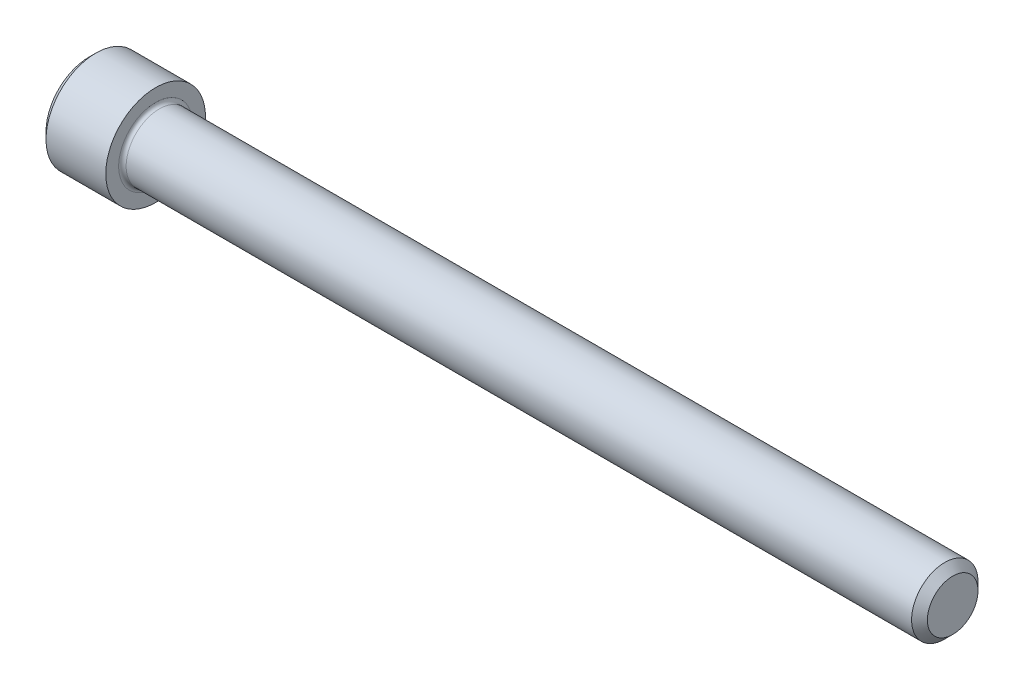
ISO-10303-21;
HEADER;
FILE_DESCRIPTION(('STEP AP214'),'2;1');
FILE_NAME('part.step','',(''),(''),'','','');
FILE_SCHEMA(('AUTOMOTIVE_DESIGN { 1 0 10303 214 1 1 1 1 }'));
ENDSEC;
DATA;
#1=APPLICATION_CONTEXT('core data for automotive mechanical design processes');
#2=APPLICATION_PROTOCOL_DEFINITION('international standard','automotive_design',2000,#1);
#3=PRODUCT_CONTEXT('',#1,'mechanical');
#4=PRODUCT('Part','Part','',(#3));
#5=PRODUCT_RELATED_PRODUCT_CATEGORY('part','',(#4));
#6=PRODUCT_DEFINITION_FORMATION('','',#4);
#7=PRODUCT_DEFINITION_CONTEXT('part definition',#1,'design');
#8=PRODUCT_DEFINITION('design','',#6,#7);
#9=PRODUCT_DEFINITION_SHAPE('','',#8);
#10=(LENGTH_UNIT() NAMED_UNIT(*) SI_UNIT(.MILLI.,.METRE.));
#11=(NAMED_UNIT(*) PLANE_ANGLE_UNIT() SI_UNIT($,.RADIAN.));
#12=(NAMED_UNIT(*) SI_UNIT($,.STERADIAN.) SOLID_ANGLE_UNIT());
#13=UNCERTAINTY_MEASURE_WITH_UNIT(LENGTH_MEASURE(1.E-05),#10,'distance_accuracy_value','');
#14=(GEOMETRIC_REPRESENTATION_CONTEXT(3) GLOBAL_UNCERTAINTY_ASSIGNED_CONTEXT((#13)) GLOBAL_UNIT_ASSIGNED_CONTEXT((#10,
#11,#12)) REPRESENTATION_CONTEXT('',''));
#15=CARTESIAN_POINT('',(0.,0.,0.));
#16=DIRECTION('',(0.,0.,1.));
#17=DIRECTION('',(1.,0.,0.));
#18=AXIS2_PLACEMENT_3D('',#15,#16,#17);
#19=CARTESIAN_POINT('',(0.,0.,0.));
#20=DIRECTION('',(-1.,0.,0.));
#21=DIRECTION('',(0.,0.,1.));
#22=AXIS2_PLACEMENT_3D('',#19,#20,#21);
#23=PLANE('',#22);
#24=DIRECTION('',(0.,-0.499999999999998,0.86602540378444));
#25=VECTOR('',#24,1.);
#26=CARTESIAN_POINT('',(0.,2.7496306570156,0.));
#27=LINE('',#26,#25);
#28=CARTESIAN_POINT('',(0.,2.7496306570156,0.));
#29=VERTEX_POINT('',#28);
#30=CARTESIAN_POINT('',(0.,1.37481532850781,2.38125));
#31=VERTEX_POINT('',#30);
#32=EDGE_CURVE('E387',#29,#31,#27,.T.);
#33=ORIENTED_EDGE('',*,*,#32,.T.);
#34=DIRECTION('',(0.,1.,0.));
#35=VECTOR('',#34,1.);
#36=CARTESIAN_POINT('',(0.,-1.37481532850779,2.38125));
#37=LINE('',#36,#35);
#38=CARTESIAN_POINT('',(0.,-1.37481532850779,2.38125));
#39=VERTEX_POINT('',#38);
#40=EDGE_CURVE('E131',#39,#31,#37,.T.);
#41=ORIENTED_EDGE('',*,*,#40,.F.);
#42=DIRECTION('',(0.,-0.500000000000001,-0.866025403784438));
#43=VECTOR('',#42,1.);
#44=CARTESIAN_POINT('',(0.,-1.37481532850779,2.38125));
#45=LINE('',#44,#43);
#46=CARTESIAN_POINT('',(0.,-2.74963065701559,0.));
#47=VERTEX_POINT('',#46);
#48=EDGE_CURVE('E390',#39,#47,#45,.T.);
#49=ORIENTED_EDGE('',*,*,#48,.T.);
#50=DIRECTION('',(0.,0.499999999999998,-0.86602540378444));
#51=VECTOR('',#50,1.);
#52=CARTESIAN_POINT('',(0.,-2.74963065701559,0.));
#53=LINE('',#52,#51);
#54=CARTESIAN_POINT('',(0.,-1.37481532850779,-2.38125));
#55=VERTEX_POINT('',#54);
#56=EDGE_CURVE('E393',#47,#55,#53,.T.);
#57=ORIENTED_EDGE('',*,*,#56,.T.);
#58=DIRECTION('',(0.,-1.,0.));
#59=VECTOR('',#58,1.);
#60=CARTESIAN_POINT('',(0.,1.3748153285078,-2.38125));
#61=LINE('',#60,#59);
#62=CARTESIAN_POINT('',(0.,1.3748153285078,-2.38125));
#63=VERTEX_POINT('',#62);
#64=EDGE_CURVE('E396',#63,#55,#61,.T.);
#65=ORIENTED_EDGE('',*,*,#64,.F.);
#66=DIRECTION('',(0.,-0.500000000000001,-0.866025403784438));
#67=VECTOR('',#66,1.);
#68=CARTESIAN_POINT('',(0.,2.7496306570156,0.));
#69=LINE('',#68,#67);
#70=EDGE_CURVE('E126',#29,#63,#69,.T.);
#71=ORIENTED_EDGE('',*,*,#70,.F.);
#72=EDGE_LOOP('',(#33,#41,#49,#57,#65,#71));
#73=FACE_BOUND('',#72,.T.);
#74=CARTESIAN_POINT('',(0.,0.,0.));
#75=DIRECTION('',(-1.,0.,0.));
#76=DIRECTION('',(0.,0.,1.));
#77=AXIS2_PLACEMENT_3D('',#74,#75,#76);
#78=CIRCLE('',#77,4.1275);
#79=CARTESIAN_POINT('',(0.,0.,4.1275));
#80=VERTEX_POINT('',#79);
#81=EDGE_CURVE('E142',#80,#80,#78,.T.);
#82=ORIENTED_EDGE('',*,*,#81,.T.);
#83=EDGE_LOOP('',(#82));
#84=FACE_BOUND('',#83,.T.);
#85=ADVANCED_FACE('F35',(#73,#84),#23,.T.);
#86=CARTESIAN_POINT('',(82.55,2.41935,0.));
#87=DIRECTION('',(1.,0.,0.));
#88=DIRECTION('',(0.,0.,-1.));
#89=AXIS2_PLACEMENT_3D('',#86,#87,#88);
#90=PLANE('',#89);
#91=CARTESIAN_POINT('',(82.55,0.,0.));
#92=DIRECTION('',(-1.,0.,0.));
#93=DIRECTION('',(0.,0.,1.));
#94=AXIS2_PLACEMENT_3D('',#91,#92,#93);
#95=CIRCLE('',#94,2.41935);
#96=CARTESIAN_POINT('',(82.55,0.,2.41935));
#97=VERTEX_POINT('',#96);
#98=EDGE_CURVE('E155',#97,#97,#95,.T.);
#99=ORIENTED_EDGE('',*,*,#98,.F.);
#100=EDGE_LOOP('',(#99));
#101=FACE_BOUND('',#100,.T.);
#102=ADVANCED_FACE('F176',(#101),#90,.T.);
#103=CARTESIAN_POINT('',(82.55,0.,0.));
#104=DIRECTION('',(-1.,0.,0.));
#105=DIRECTION('',(0.,0.,1.));
#106=AXIS2_PLACEMENT_3D('',#103,#104,#105);
#107=CONICAL_SURFACE('',#106,2.41935,0.785398163397347);
#108=CARTESIAN_POINT('',(81.7943499999999,0.,0.));
#109=DIRECTION('',(-1.,0.,0.));
#110=DIRECTION('',(0.,0.,1.));
#111=AXIS2_PLACEMENT_3D('',#108,#109,#110);
#112=CIRCLE('',#111,3.17499999999991);
#113=CARTESIAN_POINT('',(81.7943499999999,0.,3.17499999999991));
#114=VERTEX_POINT('',#113);
#115=EDGE_CURVE('E152',#114,#114,#112,.T.);
#116=ORIENTED_EDGE('',*,*,#115,.F.);
#117=EDGE_LOOP('',(#116));
#118=FACE_BOUND('',#117,.T.);
#119=ORIENTED_EDGE('',*,*,#98,.T.);
#120=EDGE_LOOP('',(#119));
#121=FACE_BOUND('',#120,.T.);
#122=ADVANCED_FACE('F182',(#118,#121),#107,.T.);
#123=CARTESIAN_POINT('',(-31.75,0.,0.));
#124=DIRECTION('',(-1.,0.,0.));
#125=DIRECTION('',(0.,0.,1.));
#126=AXIS2_PLACEMENT_3D('',#123,#124,#125);
#127=CYLINDRICAL_SURFACE('',#126,3.17499999999996);
#128=CARTESIAN_POINT('',(6.7056,0.,0.));
#129=DIRECTION('',(1.,0.,0.));
#130=DIRECTION('',(0.,0.,-1.));
#131=AXIS2_PLACEMENT_3D('',#128,#129,#130);
#132=CIRCLE('',#131,3.17499999999996);
#133=CARTESIAN_POINT('',(6.7056,0.,-3.17499999999996));
#134=VERTEX_POINT('',#133);
#135=EDGE_CURVE('E11',#134,#134,#132,.T.);
#136=ORIENTED_EDGE('',*,*,#135,.T.);
#137=EDGE_LOOP('',(#136));
#138=FACE_BOUND('',#137,.T.);
#139=ORIENTED_EDGE('',*,*,#115,.T.);
#140=EDGE_LOOP('',(#139));
#141=FACE_BOUND('',#140,.T.);
#142=ADVANCED_FACE('F193',(#138,#141),#127,.T.);
#143=CARTESIAN_POINT('',(6.35,4.7625,0.));
#144=DIRECTION('',(1.,0.,0.));
#145=DIRECTION('',(0.,0.,-1.));
#146=AXIS2_PLACEMENT_3D('',#143,#144,#145);
#147=PLANE('',#146);
#148=CARTESIAN_POINT('',(6.35,0.,0.));
#149=DIRECTION('',(1.,0.,0.));
#150=DIRECTION('',(0.,0.,-1.));
#151=AXIS2_PLACEMENT_3D('',#148,#149,#150);
#152=CIRCLE('',#151,3.53059999999996);
#153=CARTESIAN_POINT('',(6.35,0.,-3.53059999999996));
#154=VERTEX_POINT('',#153);
#155=EDGE_CURVE('E43',#154,#154,#152,.F.);
#156=ORIENTED_EDGE('',*,*,#155,.T.);
#157=EDGE_LOOP('',(#156));
#158=FACE_BOUND('',#157,.T.);
#159=CARTESIAN_POINT('',(6.35,0.,0.));
#160=DIRECTION('',(-1.,0.,0.));
#161=DIRECTION('',(0.,0.,1.));
#162=AXIS2_PLACEMENT_3D('',#159,#160,#161);
#163=CIRCLE('',#162,4.7625);
#164=CARTESIAN_POINT('',(6.35,0.,4.7625));
#165=VERTEX_POINT('',#164);
#166=EDGE_CURVE('E149',#165,#165,#163,.T.);
#167=ORIENTED_EDGE('',*,*,#166,.F.);
#168=EDGE_LOOP('',(#167));
#169=FACE_BOUND('',#168,.T.);
#170=ADVANCED_FACE('F160',(#158,#169),#147,.T.);
#171=CARTESIAN_POINT('',(-31.75,0.,0.));
#172=DIRECTION('',(-1.,0.,0.));
#173=DIRECTION('',(0.,0.,1.));
#174=AXIS2_PLACEMENT_3D('',#171,#172,#173);
#175=CYLINDRICAL_SURFACE('',#174,4.7625);
#176=ORIENTED_EDGE('',*,*,#166,.T.);
#177=EDGE_LOOP('',(#176));
#178=FACE_BOUND('',#177,.T.);
#179=CARTESIAN_POINT('',(0.634999999999997,0.,0.));
#180=DIRECTION('',(-1.,0.,0.));
#181=DIRECTION('',(0.,0.,1.));
#182=AXIS2_PLACEMENT_3D('',#179,#180,#181);
#183=CIRCLE('',#182,4.7625);
#184=CARTESIAN_POINT('',(0.634999999999997,0.,4.7625));
#185=VERTEX_POINT('',#184);
#186=EDGE_CURVE('E146',#185,#185,#183,.T.);
#187=ORIENTED_EDGE('',*,*,#186,.F.);
#188=EDGE_LOOP('',(#187));
#189=FACE_BOUND('',#188,.T.);
#190=ADVANCED_FACE('F171',(#178,#189),#175,.T.);
#191=CARTESIAN_POINT('',(0.,0.,0.));
#192=DIRECTION('',(1.,0.,0.));
#193=DIRECTION('',(0.,0.,-1.));
#194=AXIS2_PLACEMENT_3D('',#191,#192,#193);
#195=CONICAL_SURFACE('',#194,4.1275,0.785398163397449);
#196=ORIENTED_EDGE('',*,*,#186,.T.);
#197=EDGE_LOOP('',(#196));
#198=FACE_BOUND('',#197,.T.);
#199=ORIENTED_EDGE('',*,*,#81,.F.);
#200=EDGE_LOOP('',(#199));
#201=FACE_BOUND('',#200,.T.);
#202=ADVANCED_FACE('F164',(#198,#201),#195,.T.);
#203=CARTESIAN_POINT('',(6.7056,0.,0.));
#204=DIRECTION('',(1.,0.,0.));
#205=DIRECTION('',(0.,0.,-1.));
#206=AXIS2_PLACEMENT_3D('',#203,#204,#205);
#207=TOROIDAL_SURFACE('',#206,3.53059999999996,0.3556);
#208=ORIENTED_EDGE('',*,*,#135,.F.);
#209=EDGE_LOOP('',(#208));
#210=FACE_BOUND('',#209,.T.);
#211=ORIENTED_EDGE('',*,*,#155,.F.);
#212=EDGE_LOOP('',(#211));
#213=FACE_BOUND('',#212,.T.);
#214=ADVANCED_FACE('F37',(#210,#213),#207,.F.);
#215=CARTESIAN_POINT('',(3.048,2.7496306570156,0.));
#216=DIRECTION('',(0.,-0.86602540378444,-0.499999999999998));
#217=DIRECTION('',(0.,0.499999999999998,-0.86602540378444));
#218=AXIS2_PLACEMENT_3D('',#215,#216,#217);
#219=PLANE('',#218);
#220=ORIENTED_EDGE('',*,*,#32,.F.);
#221=DIRECTION('',(-1.,0.,0.));
#222=VECTOR('',#221,1.);
#223=CARTESIAN_POINT('',(3.048,2.7496306570156,0.));
#224=LINE('',#223,#222);
#225=CARTESIAN_POINT('',(3.048,2.7496306570156,0.));
#226=VERTEX_POINT('',#225);
#227=EDGE_CURVE('E377',#226,#29,#224,.T.);
#228=ORIENTED_EDGE('',*,*,#227,.F.);
#229=DIRECTION('',(0.,-0.499999999999998,0.86602540378444));
#230=VECTOR('',#229,1.);
#231=CARTESIAN_POINT('',(3.048,2.7496306570156,0.));
#232=LINE('',#231,#230);
#233=CARTESIAN_POINT('',(3.048,2.0622229927617,1.190625));
#234=VERTEX_POINT('',#233);
#235=EDGE_CURVE('E118',#226,#234,#232,.T.);
#236=ORIENTED_EDGE('',*,*,#235,.T.);
#237=CARTESIAN_POINT('',(3.048,1.37481532850781,2.38125));
#238=VERTEX_POINT('',#237);
#239=EDGE_CURVE('E109',#234,#238,#232,.T.);
#240=ORIENTED_EDGE('',*,*,#239,.T.);
#241=DIRECTION('',(-1.,0.,0.));
#242=VECTOR('',#241,1.);
#243=CARTESIAN_POINT('',(3.048,1.37481532850781,2.38125));
#244=LINE('',#243,#242);
#245=EDGE_CURVE('E123',#238,#31,#244,.T.);
#246=ORIENTED_EDGE('',*,*,#245,.T.);
#247=EDGE_LOOP('',(#220,#228,#236,#240,#246));
#248=FACE_BOUND('',#247,.T.);
#249=ADVANCED_FACE('F122',(#248),#219,.T.);
#250=CARTESIAN_POINT('',(3.048,-1.37481532850779,2.38125));
#251=DIRECTION('',(0.,0.,1.));
#252=DIRECTION('',(0.,-1.,0.));
#253=AXIS2_PLACEMENT_3D('',#250,#251,#252);
#254=PLANE('',#253);
#255=ORIENTED_EDGE('',*,*,#40,.T.);
#256=ORIENTED_EDGE('',*,*,#245,.F.);
#257=DIRECTION('',(0.,1.,0.));
#258=VECTOR('',#257,1.);
#259=CARTESIAN_POINT('',(3.048,-1.37481532850779,2.38125));
#260=LINE('',#259,#258);
#261=CARTESIAN_POINT('',(3.048,0.,2.38125));
#262=VERTEX_POINT('',#261);
#263=EDGE_CURVE('E106',#262,#238,#260,.T.);
#264=ORIENTED_EDGE('',*,*,#263,.F.);
#265=CARTESIAN_POINT('',(3.048,-1.37481532850779,2.38125));
#266=VERTEX_POINT('',#265);
#267=EDGE_CURVE('E117',#266,#262,#260,.T.);
#268=ORIENTED_EDGE('',*,*,#267,.F.);
#269=DIRECTION('',(-1.,0.,0.));
#270=VECTOR('',#269,1.);
#271=CARTESIAN_POINT('',(3.048,-1.37481532850779,2.38125));
#272=LINE('',#271,#270);
#273=EDGE_CURVE('E133',#266,#39,#272,.T.);
#274=ORIENTED_EDGE('',*,*,#273,.T.);
#275=EDGE_LOOP('',(#255,#256,#264,#268,#274));
#276=FACE_BOUND('',#275,.T.);
#277=ADVANCED_FACE('F128',(#276),#254,.F.);
#278=CARTESIAN_POINT('',(3.048,-1.37481532850779,2.38125));
#279=DIRECTION('',(0.,0.866025403784438,-0.500000000000001));
#280=DIRECTION('',(0.,0.500000000000001,0.866025403784438));
#281=AXIS2_PLACEMENT_3D('',#278,#279,#280);
#282=PLANE('',#281);
#283=ORIENTED_EDGE('',*,*,#48,.F.);
#284=ORIENTED_EDGE('',*,*,#273,.F.);
#285=DIRECTION('',(0.,-0.500000000000001,-0.866025403784438));
#286=VECTOR('',#285,1.);
#287=CARTESIAN_POINT('',(3.048,-1.37481532850779,2.38125));
#288=LINE('',#287,#286);
#289=CARTESIAN_POINT('',(3.048,-2.06222299276169,1.190625));
#290=VERTEX_POINT('',#289);
#291=EDGE_CURVE('E416',#266,#290,#288,.T.);
#292=ORIENTED_EDGE('',*,*,#291,.T.);
#293=CARTESIAN_POINT('',(3.048,-2.74963065701559,0.));
#294=VERTEX_POINT('',#293);
#295=EDGE_CURVE('E405',#290,#294,#288,.T.);
#296=ORIENTED_EDGE('',*,*,#295,.T.);
#297=DIRECTION('',(-1.,0.,0.));
#298=VECTOR('',#297,1.);
#299=CARTESIAN_POINT('',(3.048,-2.74963065701559,0.));
#300=LINE('',#299,#298);
#301=EDGE_CURVE('E138',#294,#47,#300,.T.);
#302=ORIENTED_EDGE('',*,*,#301,.T.);
#303=EDGE_LOOP('',(#283,#284,#292,#296,#302));
#304=FACE_BOUND('',#303,.T.);
#305=ADVANCED_FACE('F268',(#304),#282,.T.);
#306=CARTESIAN_POINT('',(3.048,-2.74963065701559,0.));
#307=DIRECTION('',(0.,0.86602540378444,0.499999999999998));
#308=DIRECTION('',(0.,-0.499999999999998,0.86602540378444));
#309=AXIS2_PLACEMENT_3D('',#306,#307,#308);
#310=PLANE('',#309);
#311=ORIENTED_EDGE('',*,*,#56,.F.);
#312=ORIENTED_EDGE('',*,*,#301,.F.);
#313=DIRECTION('',(0.,0.499999999999998,-0.86602540378444));
#314=VECTOR('',#313,1.);
#315=CARTESIAN_POINT('',(3.048,-2.74963065701559,0.));
#316=LINE('',#315,#314);
#317=CARTESIAN_POINT('',(3.048,-2.06222299276169,-1.19062499999999));
#318=VERTEX_POINT('',#317);
#319=EDGE_CURVE('E383',#294,#318,#316,.T.);
#320=ORIENTED_EDGE('',*,*,#319,.T.);
#321=CARTESIAN_POINT('',(3.048,-1.37481532850779,-2.38125));
#322=VERTEX_POINT('',#321);
#323=EDGE_CURVE('E415',#318,#322,#316,.T.);
#324=ORIENTED_EDGE('',*,*,#323,.T.);
#325=DIRECTION('',(-1.,0.,0.));
#326=VECTOR('',#325,1.);
#327=CARTESIAN_POINT('',(3.048,-1.37481532850779,-2.38125));
#328=LINE('',#327,#326);
#329=EDGE_CURVE('E376',#322,#55,#328,.T.);
#330=ORIENTED_EDGE('',*,*,#329,.T.);
#331=EDGE_LOOP('',(#311,#312,#320,#324,#330));
#332=FACE_BOUND('',#331,.T.);
#333=ADVANCED_FACE('F276',(#332),#310,.T.);
#334=CARTESIAN_POINT('',(3.048,1.3748153285078,-2.38125));
#335=DIRECTION('',(0.,0.,-1.));
#336=DIRECTION('',(0.,1.,0.));
#337=AXIS2_PLACEMENT_3D('',#334,#335,#336);
#338=PLANE('',#337);
#339=ORIENTED_EDGE('',*,*,#64,.T.);
#340=ORIENTED_EDGE('',*,*,#329,.F.);
#341=DIRECTION('',(0.,-1.,0.));
#342=VECTOR('',#341,1.);
#343=CARTESIAN_POINT('',(3.048,1.3748153285078,-2.38125));
#344=LINE('',#343,#342);
#345=CARTESIAN_POINT('',(3.048,0.,-2.38125));
#346=VERTEX_POINT('',#345);
#347=EDGE_CURVE('E380',#346,#322,#344,.T.);
#348=ORIENTED_EDGE('',*,*,#347,.F.);
#349=CARTESIAN_POINT('',(3.048,1.3748153285078,-2.38125));
#350=VERTEX_POINT('',#349);
#351=EDGE_CURVE('E50',#350,#346,#344,.T.);
#352=ORIENTED_EDGE('',*,*,#351,.F.);
#353=DIRECTION('',(-1.,0.,0.));
#354=VECTOR('',#353,1.);
#355=CARTESIAN_POINT('',(3.048,1.3748153285078,-2.38125));
#356=LINE('',#355,#354);
#357=EDGE_CURVE('E373',#350,#63,#356,.T.);
#358=ORIENTED_EDGE('',*,*,#357,.T.);
#359=EDGE_LOOP('',(#339,#340,#348,#352,#358));
#360=FACE_BOUND('',#359,.T.);
#361=ADVANCED_FACE('F285',(#360),#338,.F.);
#362=CARTESIAN_POINT('',(3.048,2.7496306570156,0.));
#363=DIRECTION('',(0.,0.866025403784438,-0.500000000000001));
#364=DIRECTION('',(0.,0.500000000000001,0.866025403784438));
#365=AXIS2_PLACEMENT_3D('',#362,#363,#364);
#366=PLANE('',#365);
#367=ORIENTED_EDGE('',*,*,#70,.T.);
#368=ORIENTED_EDGE('',*,*,#357,.F.);
#369=DIRECTION('',(0.,-0.500000000000001,-0.866025403784438));
#370=VECTOR('',#369,1.);
#371=CARTESIAN_POINT('',(3.048,2.7496306570156,0.));
#372=LINE('',#371,#370);
#373=CARTESIAN_POINT('',(3.048,2.0622229927617,-1.19062500000001));
#374=VERTEX_POINT('',#373);
#375=EDGE_CURVE('E363',#374,#350,#372,.T.);
#376=ORIENTED_EDGE('',*,*,#375,.F.);
#377=EDGE_CURVE('E369',#226,#374,#372,.T.);
#378=ORIENTED_EDGE('',*,*,#377,.F.);
#379=ORIENTED_EDGE('',*,*,#227,.T.);
#380=EDGE_LOOP('',(#367,#368,#376,#378,#379));
#381=FACE_BOUND('',#380,.T.);
#382=ADVANCED_FACE('F294',(#381),#366,.F.);
#383=CARTESIAN_POINT('',(3.048,4.12444598552339,-2.38125000000001));
#384=DIRECTION('',(1.,0.,0.));
#385=DIRECTION('',(0.,0.,-1.));
#386=AXIS2_PLACEMENT_3D('',#383,#384,#385);
#387=PLANE('',#386);
#388=ORIENTED_EDGE('',*,*,#347,.T.);
#389=ORIENTED_EDGE('',*,*,#323,.F.);
#390=CARTESIAN_POINT('',(3.048,0.,0.));
#391=DIRECTION('',(-1.,0.,0.));
#392=DIRECTION('',(0.,0.,1.));
#393=AXIS2_PLACEMENT_3D('',#390,#391,#392);
#394=CIRCLE('',#393,2.38125);
#395=EDGE_CURVE('E411',#346,#318,#394,.T.);
#396=ORIENTED_EDGE('',*,*,#395,.F.);
#397=EDGE_LOOP('',(#388,#389,#396));
#398=FACE_BOUND('',#397,.T.);
#399=ADVANCED_FACE('F303',(#398),#387,.F.);
#400=ORIENTED_EDGE('',*,*,#319,.F.);
#401=ORIENTED_EDGE('',*,*,#295,.F.);
#402=EDGE_CURVE('E136',#318,#290,#394,.T.);
#403=ORIENTED_EDGE('',*,*,#402,.F.);
#404=EDGE_LOOP('',(#400,#401,#403));
#405=FACE_BOUND('',#404,.T.);
#406=ADVANCED_FACE('F312',(#405),#387,.F.);
#407=ORIENTED_EDGE('',*,*,#291,.F.);
#408=ORIENTED_EDGE('',*,*,#267,.T.);
#409=EDGE_CURVE('E132',#290,#262,#394,.T.);
#410=ORIENTED_EDGE('',*,*,#409,.F.);
#411=EDGE_LOOP('',(#407,#408,#410));
#412=FACE_BOUND('',#411,.T.);
#413=ADVANCED_FACE('F321',(#412),#387,.F.);
#414=ORIENTED_EDGE('',*,*,#263,.T.);
#415=ORIENTED_EDGE('',*,*,#239,.F.);
#416=EDGE_CURVE('E112',#262,#234,#394,.T.);
#417=ORIENTED_EDGE('',*,*,#416,.F.);
#418=EDGE_LOOP('',(#414,#415,#417));
#419=FACE_BOUND('',#418,.T.);
#420=ADVANCED_FACE('F108',(#419),#387,.F.);
#421=ORIENTED_EDGE('',*,*,#235,.F.);
#422=ORIENTED_EDGE('',*,*,#377,.T.);
#423=EDGE_CURVE('E143',#234,#374,#394,.T.);
#424=ORIENTED_EDGE('',*,*,#423,.F.);
#425=EDGE_LOOP('',(#421,#422,#424));
#426=FACE_BOUND('',#425,.T.);
#427=ADVANCED_FACE('F336',(#426),#387,.F.);
#428=ORIENTED_EDGE('',*,*,#375,.T.);
#429=ORIENTED_EDGE('',*,*,#351,.T.);
#430=EDGE_CURVE('E366',#374,#346,#394,.T.);
#431=ORIENTED_EDGE('',*,*,#430,.F.);
#432=EDGE_LOOP('',(#428,#429,#431));
#433=FACE_BOUND('',#432,.T.);
#434=ADVANCED_FACE('F251',(#433),#387,.F.);
#435=CARTESIAN_POINT('',(3.048,0.,0.));
#436=DIRECTION('',(-1.,0.,0.));
#437=DIRECTION('',(0.,0.,1.));
#438=AXIS2_PLACEMENT_3D('',#435,#436,#437);
#439=CONICAL_SURFACE('',#438,2.38125,1.04719755119659);
#440=CARTESIAN_POINT('',(4.42281532850781,0.,0.));
#441=VERTEX_POINT('',#440);
#442=VERTEX_LOOP('',#441);
#443=FACE_BOUND('',#442,.T.);
#444=ORIENTED_EDGE('',*,*,#416,.T.);
#445=ORIENTED_EDGE('',*,*,#423,.T.);
#446=ORIENTED_EDGE('',*,*,#430,.T.);
#447=ORIENTED_EDGE('',*,*,#395,.T.);
#448=ORIENTED_EDGE('',*,*,#402,.T.);
#449=ORIENTED_EDGE('',*,*,#409,.T.);
#450=EDGE_LOOP('',(#444,#445,#446,#447,#448,#449));
#451=FACE_BOUND('',#450,.T.);
#452=ADVANCED_FACE('F186',(#443,#451),#439,.F.);
#453=CLOSED_SHELL('',(#85,#102,#122,#142,#170,#190,#202,#214,#249,#277,#305,#333,#361,#382,#399,
#406,#413,#420,#427,#434,#452));
#454=MANIFOLD_SOLID_BREP('B2',#453);
#455=ADVANCED_BREP_SHAPE_REPRESENTATION('',(#18,#454),#14);
#456=SHAPE_DEFINITION_REPRESENTATION(#9,#455);
ENDSEC;
END-ISO-10303-21;
